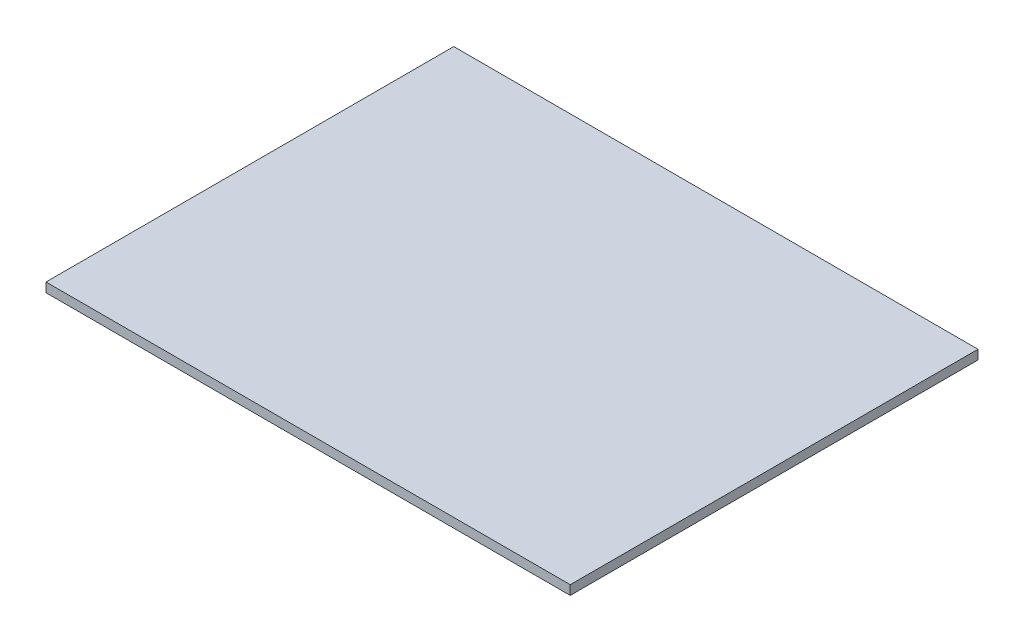
ISO-10303-21;
HEADER;
FILE_DESCRIPTION(('STEP AP214'),'2;1');
FILE_NAME('part.step','',(''),(''),'','','');
FILE_SCHEMA(('AUTOMOTIVE_DESIGN { 1 0 10303 214 1 1 1 1 }'));
ENDSEC;
DATA;
#1=APPLICATION_CONTEXT('core data for automotive mechanical design processes');
#2=APPLICATION_PROTOCOL_DEFINITION('international standard','automotive_design',2000,#1);
#3=PRODUCT_CONTEXT('',#1,'mechanical');
#4=PRODUCT('Part','Part','',(#3));
#5=PRODUCT_RELATED_PRODUCT_CATEGORY('part','',(#4));
#6=PRODUCT_DEFINITION_FORMATION('','',#4);
#7=PRODUCT_DEFINITION_CONTEXT('part definition',#1,'design');
#8=PRODUCT_DEFINITION('design','',#6,#7);
#9=PRODUCT_DEFINITION_SHAPE('','',#8);
#10=(LENGTH_UNIT() NAMED_UNIT(*) SI_UNIT(.MILLI.,.METRE.));
#11=(NAMED_UNIT(*) PLANE_ANGLE_UNIT() SI_UNIT($,.RADIAN.));
#12=(NAMED_UNIT(*) SI_UNIT($,.STERADIAN.) SOLID_ANGLE_UNIT());
#13=UNCERTAINTY_MEASURE_WITH_UNIT(LENGTH_MEASURE(1.E-05),#10,'distance_accuracy_value','');
#14=(GEOMETRIC_REPRESENTATION_CONTEXT(3) GLOBAL_UNCERTAINTY_ASSIGNED_CONTEXT((#13)) GLOBAL_UNIT_ASSIGNED_CONTEXT((#10,
#11,#12)) REPRESENTATION_CONTEXT('',''));
#15=CARTESIAN_POINT('',(0.,0.,0.));
#16=DIRECTION('',(0.,0.,1.));
#17=DIRECTION('',(1.,0.,0.));
#18=AXIS2_PLACEMENT_3D('',#15,#16,#17);
#19=CARTESIAN_POINT('',(0.,1.6,0.));
#20=DIRECTION('',(1.,0.,0.));
#21=DIRECTION('',(0.,0.,-1.));
#22=AXIS2_PLACEMENT_3D('',#19,#20,#21);
#23=PLANE('',#22);
#24=DIRECTION('',(0.,0.,1.));
#25=VECTOR('',#24,1.);
#26=CARTESIAN_POINT('',(0.,0.,0.));
#27=LINE('',#26,#25);
#28=CARTESIAN_POINT('',(0.,0.,-70.));
#29=VERTEX_POINT('',#28);
#30=CARTESIAN_POINT('',(0.,0.,0.));
#31=VERTEX_POINT('',#30);
#32=EDGE_CURVE('E98',#29,#31,#27,.T.);
#33=ORIENTED_EDGE('',*,*,#32,.T.);
#34=DIRECTION('',(0.,-1.,0.));
#35=VECTOR('',#34,1.);
#36=CARTESIAN_POINT('',(0.,1.6,0.));
#37=LINE('',#36,#35);
#38=CARTESIAN_POINT('',(0.,1.6,0.));
#39=VERTEX_POINT('',#38);
#40=EDGE_CURVE('E11',#39,#31,#37,.T.);
#41=ORIENTED_EDGE('',*,*,#40,.F.);
#42=DIRECTION('',(0.,0.,1.));
#43=VECTOR('',#42,1.);
#44=CARTESIAN_POINT('',(0.,1.6,0.));
#45=LINE('',#44,#43);
#46=CARTESIAN_POINT('',(0.,1.6,-70.));
#47=VERTEX_POINT('',#46);
#48=EDGE_CURVE('E86',#47,#39,#45,.T.);
#49=ORIENTED_EDGE('',*,*,#48,.F.);
#50=DIRECTION('',(0.,-1.,0.));
#51=VECTOR('',#50,1.);
#52=CARTESIAN_POINT('',(0.,1.6,-70.));
#53=LINE('',#52,#51);
#54=EDGE_CURVE('E94',#47,#29,#53,.T.);
#55=ORIENTED_EDGE('',*,*,#54,.T.);
#56=EDGE_LOOP('',(#33,#41,#49,#55));
#57=FACE_BOUND('',#56,.T.);
#58=ADVANCED_FACE('F35',(#57),#23,.F.);
#59=CARTESIAN_POINT('',(0.,1.6,0.));
#60=DIRECTION('',(0.,0.,-1.));
#61=DIRECTION('',(-1.,0.,0.));
#62=AXIS2_PLACEMENT_3D('',#59,#60,#61);
#63=PLANE('',#62);
#64=DIRECTION('',(1.,0.,0.));
#65=VECTOR('',#64,1.);
#66=CARTESIAN_POINT('',(0.,0.,0.));
#67=LINE('',#66,#65);
#68=CARTESIAN_POINT('',(90.,0.,0.));
#69=VERTEX_POINT('',#68);
#70=EDGE_CURVE('E90',#31,#69,#67,.T.);
#71=ORIENTED_EDGE('',*,*,#70,.T.);
#72=DIRECTION('',(0.,-1.,0.));
#73=VECTOR('',#72,1.);
#74=CARTESIAN_POINT('',(90.,1.6,0.));
#75=LINE('',#74,#73);
#76=CARTESIAN_POINT('',(90.,1.6,0.));
#77=VERTEX_POINT('',#76);
#78=EDGE_CURVE('E43',#77,#69,#75,.T.);
#79=ORIENTED_EDGE('',*,*,#78,.F.);
#80=DIRECTION('',(1.,0.,0.));
#81=VECTOR('',#80,1.);
#82=CARTESIAN_POINT('',(0.,1.6,0.));
#83=LINE('',#82,#81);
#84=EDGE_CURVE('E81',#39,#77,#83,.T.);
#85=ORIENTED_EDGE('',*,*,#84,.F.);
#86=ORIENTED_EDGE('',*,*,#40,.T.);
#87=EDGE_LOOP('',(#71,#79,#85,#86));
#88=FACE_BOUND('',#87,.T.);
#89=ADVANCED_FACE('F89',(#88),#63,.F.);
#90=CARTESIAN_POINT('',(90.,1.6,0.));
#91=DIRECTION('',(-1.,0.,0.));
#92=DIRECTION('',(0.,0.,1.));
#93=AXIS2_PLACEMENT_3D('',#90,#91,#92);
#94=PLANE('',#93);
#95=DIRECTION('',(0.,0.,-1.));
#96=VECTOR('',#95,1.);
#97=CARTESIAN_POINT('',(90.,0.,0.));
#98=LINE('',#97,#96);
#99=CARTESIAN_POINT('',(90.,0.,-70.));
#100=VERTEX_POINT('',#99);
#101=EDGE_CURVE('E68',#69,#100,#98,.T.);
#102=ORIENTED_EDGE('',*,*,#101,.T.);
#103=DIRECTION('',(0.,-1.,0.));
#104=VECTOR('',#103,1.);
#105=CARTESIAN_POINT('',(90.,1.6,-70.));
#106=LINE('',#105,#104);
#107=CARTESIAN_POINT('',(90.,1.6,-70.));
#108=VERTEX_POINT('',#107);
#109=EDGE_CURVE('E91',#108,#100,#106,.T.);
#110=ORIENTED_EDGE('',*,*,#109,.F.);
#111=DIRECTION('',(0.,0.,-1.));
#112=VECTOR('',#111,1.);
#113=CARTESIAN_POINT('',(90.,1.6,0.));
#114=LINE('',#113,#112);
#115=EDGE_CURVE('E84',#77,#108,#114,.T.);
#116=ORIENTED_EDGE('',*,*,#115,.F.);
#117=ORIENTED_EDGE('',*,*,#78,.T.);
#118=EDGE_LOOP('',(#102,#110,#116,#117));
#119=FACE_BOUND('',#118,.T.);
#120=ADVANCED_FACE('F92',(#119),#94,.F.);
#121=CARTESIAN_POINT('',(0.,1.6,-70.));
#122=DIRECTION('',(0.,0.,1.));
#123=DIRECTION('',(1.,0.,0.));
#124=AXIS2_PLACEMENT_3D('',#121,#122,#123);
#125=PLANE('',#124);
#126=DIRECTION('',(-1.,0.,0.));
#127=VECTOR('',#126,1.);
#128=CARTESIAN_POINT('',(0.,0.,-70.));
#129=LINE('',#128,#127);
#130=EDGE_CURVE('E74',#100,#29,#129,.T.);
#131=ORIENTED_EDGE('',*,*,#130,.T.);
#132=ORIENTED_EDGE('',*,*,#54,.F.);
#133=DIRECTION('',(-1.,0.,0.));
#134=VECTOR('',#133,1.);
#135=CARTESIAN_POINT('',(0.,1.6,-70.));
#136=LINE('',#135,#134);
#137=EDGE_CURVE('E51',#108,#47,#136,.T.);
#138=ORIENTED_EDGE('',*,*,#137,.F.);
#139=ORIENTED_EDGE('',*,*,#109,.T.);
#140=EDGE_LOOP('',(#131,#132,#138,#139));
#141=FACE_BOUND('',#140,.T.);
#142=ADVANCED_FACE('F105',(#141),#125,.F.);
#143=CARTESIAN_POINT('',(0.,1.6,0.));
#144=DIRECTION('',(0.,-1.,0.));
#145=DIRECTION('',(0.,0.,-1.));
#146=AXIS2_PLACEMENT_3D('',#143,#144,#145);
#147=PLANE('',#146);
#148=ORIENTED_EDGE('',*,*,#48,.T.);
#149=ORIENTED_EDGE('',*,*,#84,.T.);
#150=ORIENTED_EDGE('',*,*,#115,.T.);
#151=ORIENTED_EDGE('',*,*,#137,.T.);
#152=EDGE_LOOP('',(#148,#149,#150,#151));
#153=FACE_BOUND('',#152,.T.);
#154=ADVANCED_FACE('F82',(#153),#147,.F.);
#155=CARTESIAN_POINT('',(0.,0.,0.));
#156=DIRECTION('',(0.,-1.,0.));
#157=DIRECTION('',(0.,0.,-1.));
#158=AXIS2_PLACEMENT_3D('',#155,#156,#157);
#159=PLANE('',#158);
#160=ORIENTED_EDGE('',*,*,#32,.F.);
#161=ORIENTED_EDGE('',*,*,#130,.F.);
#162=ORIENTED_EDGE('',*,*,#101,.F.);
#163=ORIENTED_EDGE('',*,*,#70,.F.);
#164=EDGE_LOOP('',(#160,#161,#162,#163));
#165=FACE_BOUND('',#164,.T.);
#166=ADVANCED_FACE('F108',(#165),#159,.T.);
#167=CLOSED_SHELL('',(#58,#89,#120,#142,#154,#166));
#168=MANIFOLD_SOLID_BREP('B2',#167);
#169=ADVANCED_BREP_SHAPE_REPRESENTATION('',(#18,#168),#14);
#170=SHAPE_DEFINITION_REPRESENTATION(#9,#169);
ENDSEC;
END-ISO-10303-21;
